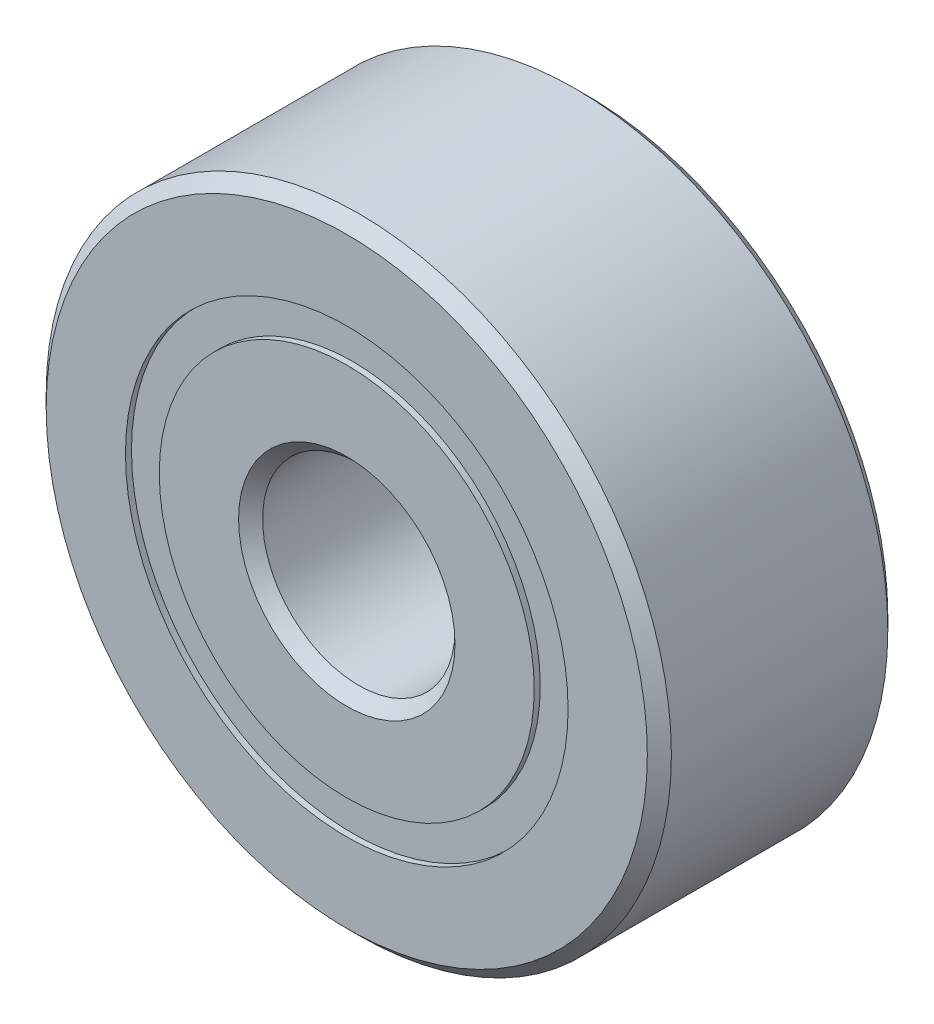
ISO-10303-21;
HEADER;
FILE_DESCRIPTION(('STEP AP214'),'2;1');
FILE_NAME('part.step','',(''),(''),'','','');
FILE_SCHEMA(('AUTOMOTIVE_DESIGN { 1 0 10303 214 1 1 1 1 }'));
ENDSEC;
DATA;
#1=APPLICATION_CONTEXT('core data for automotive mechanical design processes');
#2=APPLICATION_PROTOCOL_DEFINITION('international standard','automotive_design',2000,#1);
#3=PRODUCT_CONTEXT('',#1,'mechanical');
#4=PRODUCT('Part','Part','',(#3));
#5=PRODUCT_RELATED_PRODUCT_CATEGORY('part','',(#4));
#6=PRODUCT_DEFINITION_FORMATION('','',#4);
#7=PRODUCT_DEFINITION_CONTEXT('part definition',#1,'design');
#8=PRODUCT_DEFINITION('design','',#6,#7);
#9=PRODUCT_DEFINITION_SHAPE('','',#8);
#10=(LENGTH_UNIT() NAMED_UNIT(*) SI_UNIT(.MILLI.,.METRE.));
#11=(NAMED_UNIT(*) PLANE_ANGLE_UNIT() SI_UNIT($,.RADIAN.));
#12=(NAMED_UNIT(*) SI_UNIT($,.STERADIAN.) SOLID_ANGLE_UNIT());
#13=UNCERTAINTY_MEASURE_WITH_UNIT(LENGTH_MEASURE(1.E-05),#10,'distance_accuracy_value','');
#14=(GEOMETRIC_REPRESENTATION_CONTEXT(3) GLOBAL_UNCERTAINTY_ASSIGNED_CONTEXT((#13)) GLOBAL_UNIT_ASSIGNED_CONTEXT((#10,
#11,#12)) REPRESENTATION_CONTEXT('',''));
#15=CARTESIAN_POINT('',(0.,0.,0.));
#16=DIRECTION('',(0.,0.,1.));
#17=DIRECTION('',(1.,0.,0.));
#18=AXIS2_PLACEMENT_3D('',#15,#16,#17);
#19=CARTESIAN_POINT('',(0.,4.60164835164835,-2.375));
#20=DIRECTION('',(0.,0.,1.));
#21=DIRECTION('',(1.,0.,0.));
#22=AXIS2_PLACEMENT_3D('',#19,#20,#21);
#23=PLANE('',#22);
#24=CARTESIAN_POINT('',(0.,0.,-2.375));
#25=DIRECTION('',(0.,0.,1.));
#26=DIRECTION('',(1.,0.,0.));
#27=AXIS2_PLACEMENT_3D('',#24,#25,#26);
#28=CIRCLE('',#27,4.60164835164835);
#29=CARTESIAN_POINT('',(4.60164835164835,0.,-2.375));
#30=VERTEX_POINT('',#29);
#31=EDGE_CURVE('E57',#30,#30,#28,.T.);
#32=ORIENTED_EDGE('',*,*,#31,.F.);
#33=EDGE_LOOP('',(#32));
#34=FACE_BOUND('',#33,.T.);
#35=CARTESIAN_POINT('',(0.,0.,-2.375));
#36=DIRECTION('',(0.,0.,1.));
#37=DIRECTION('',(1.,0.,0.));
#38=AXIS2_PLACEMENT_3D('',#35,#36,#37);
#39=CIRCLE('',#38,3.89835164835165);
#40=CARTESIAN_POINT('',(3.89835164835165,0.,-2.375));
#41=VERTEX_POINT('',#40);
#42=EDGE_CURVE('E11',#41,#41,#39,.T.);
#43=ORIENTED_EDGE('',*,*,#42,.T.);
#44=EDGE_LOOP('',(#43));
#45=FACE_BOUND('',#44,.T.);
#46=ADVANCED_FACE('F43',(#34,#45),#23,.F.);
#47=CARTESIAN_POINT('',(0.,0.,2.5));
#48=DIRECTION('',(0.,0.,1.));
#49=DIRECTION('',(1.,0.,0.));
#50=AXIS2_PLACEMENT_3D('',#47,#48,#49);
#51=CYLINDRICAL_SURFACE('',#50,3.89835164835165);
#52=ORIENTED_EDGE('',*,*,#42,.F.);
#53=EDGE_LOOP('',(#52));
#54=FACE_BOUND('',#53,.T.);
#55=CARTESIAN_POINT('',(0.,0.,-1.16542887575844));
#56=DIRECTION('',(0.,0.,1.));
#57=DIRECTION('',(1.,0.,0.));
#58=AXIS2_PLACEMENT_3D('',#55,#56,#57);
#59=CIRCLE('',#58,3.89835164835165);
#60=CARTESIAN_POINT('',(3.89835164835165,0.,-1.16542887575844));
#61=VERTEX_POINT('',#60);
#62=EDGE_CURVE('E49',#61,#61,#59,.T.);
#63=ORIENTED_EDGE('',*,*,#62,.T.);
#64=EDGE_LOOP('',(#63));
#65=FACE_BOUND('',#64,.T.);
#66=ADVANCED_FACE('F66',(#54,#65),#51,.F.);
#67=CARTESIAN_POINT('',(0.,4.60164835164835,-1.16542887575844));
#68=DIRECTION('',(0.,0.,-1.));
#69=DIRECTION('',(-1.,0.,0.));
#70=AXIS2_PLACEMENT_3D('',#67,#68,#69);
#71=PLANE('',#70);
#72=ORIENTED_EDGE('',*,*,#62,.F.);
#73=EDGE_LOOP('',(#72));
#74=FACE_BOUND('',#73,.T.);
#75=CARTESIAN_POINT('',(0.,0.,-1.16542887575844));
#76=DIRECTION('',(0.,0.,1.));
#77=DIRECTION('',(1.,0.,0.));
#78=AXIS2_PLACEMENT_3D('',#75,#76,#77);
#79=CIRCLE('',#78,4.60164835164835);
#80=CARTESIAN_POINT('',(4.60164835164835,0.,-1.16542887575844));
#81=VERTEX_POINT('',#80);
#82=EDGE_CURVE('E53',#81,#81,#79,.T.);
#83=ORIENTED_EDGE('',*,*,#82,.T.);
#84=EDGE_LOOP('',(#83));
#85=FACE_BOUND('',#84,.T.);
#86=ADVANCED_FACE('F70',(#74,#85),#71,.F.);
#87=CARTESIAN_POINT('',(0.,0.,2.5));
#88=DIRECTION('',(0.,0.,1.));
#89=DIRECTION('',(1.,0.,0.));
#90=AXIS2_PLACEMENT_3D('',#87,#88,#89);
#91=CYLINDRICAL_SURFACE('',#90,4.60164835164835);
#92=ORIENTED_EDGE('',*,*,#82,.F.);
#93=EDGE_LOOP('',(#92));
#94=FACE_BOUND('',#93,.T.);
#95=ORIENTED_EDGE('',*,*,#31,.T.);
#96=EDGE_LOOP('',(#95));
#97=FACE_BOUND('',#96,.T.);
#98=ADVANCED_FACE('F63',(#94,#97),#91,.T.);
#99=CLOSED_SHELL('',(#46,#66,#86,#98));
#100=MANIFOLD_SOLID_BREP('B2',#99);
#101=CARTESIAN_POINT('',(0.,4.60164835164835,2.375));
#102=DIRECTION('',(0.,0.,-1.));
#103=DIRECTION('',(-1.,0.,0.));
#104=AXIS2_PLACEMENT_3D('',#101,#102,#103);
#105=PLANE('',#104);
#106=CARTESIAN_POINT('',(0.,0.,2.375));
#107=DIRECTION('',(0.,0.,1.));
#108=DIRECTION('',(1.,0.,0.));
#109=AXIS2_PLACEMENT_3D('',#106,#107,#108);
#110=CIRCLE('',#109,3.89835164835165);
#111=CARTESIAN_POINT('',(3.89835164835165,0.,2.375));
#112=VERTEX_POINT('',#111);
#113=EDGE_CURVE('E42',#112,#112,#110,.T.);
#114=ORIENTED_EDGE('',*,*,#113,.F.);
#115=EDGE_LOOP('',(#114));
#116=FACE_BOUND('',#115,.T.);
#117=CARTESIAN_POINT('',(0.,0.,2.375));
#118=DIRECTION('',(0.,0.,1.));
#119=DIRECTION('',(1.,0.,0.));
#120=AXIS2_PLACEMENT_3D('',#117,#118,#119);
#121=CIRCLE('',#120,4.60164835164835);
#122=CARTESIAN_POINT('',(4.60164835164835,0.,2.375));
#123=VERTEX_POINT('',#122);
#124=EDGE_CURVE('E124',#123,#123,#121,.T.);
#125=ORIENTED_EDGE('',*,*,#124,.T.);
#126=EDGE_LOOP('',(#125));
#127=FACE_BOUND('',#126,.T.);
#128=ADVANCED_FACE('F110',(#116,#127),#105,.F.);
#129=CARTESIAN_POINT('',(0.,0.,2.5));
#130=DIRECTION('',(0.,0.,1.));
#131=DIRECTION('',(1.,0.,0.));
#132=AXIS2_PLACEMENT_3D('',#129,#130,#131);
#133=CYLINDRICAL_SURFACE('',#132,3.89835164835165);
#134=CARTESIAN_POINT('',(0.,0.,1.16542887575844));
#135=DIRECTION('',(0.,0.,1.));
#136=DIRECTION('',(1.,0.,0.));
#137=AXIS2_PLACEMENT_3D('',#134,#135,#136);
#138=CIRCLE('',#137,3.89835164835165);
#139=CARTESIAN_POINT('',(3.89835164835165,0.,1.16542887575844));
#140=VERTEX_POINT('',#139);
#141=EDGE_CURVE('E116',#140,#140,#138,.T.);
#142=ORIENTED_EDGE('',*,*,#141,.F.);
#143=EDGE_LOOP('',(#142));
#144=FACE_BOUND('',#143,.T.);
#145=ORIENTED_EDGE('',*,*,#113,.T.);
#146=EDGE_LOOP('',(#145));
#147=FACE_BOUND('',#146,.T.);
#148=ADVANCED_FACE('F139',(#144,#147),#133,.F.);
#149=CARTESIAN_POINT('',(0.,4.60164835164835,1.16542887575844));
#150=DIRECTION('',(0.,0.,1.));
#151=DIRECTION('',(1.,0.,0.));
#152=AXIS2_PLACEMENT_3D('',#149,#150,#151);
#153=PLANE('',#152);
#154=CARTESIAN_POINT('',(0.,0.,1.16542887575844));
#155=DIRECTION('',(0.,0.,1.));
#156=DIRECTION('',(1.,0.,0.));
#157=AXIS2_PLACEMENT_3D('',#154,#155,#156);
#158=CIRCLE('',#157,4.60164835164835);
#159=CARTESIAN_POINT('',(4.60164835164835,0.,1.16542887575844));
#160=VERTEX_POINT('',#159);
#161=EDGE_CURVE('E120',#160,#160,#158,.T.);
#162=ORIENTED_EDGE('',*,*,#161,.F.);
#163=EDGE_LOOP('',(#162));
#164=FACE_BOUND('',#163,.T.);
#165=ORIENTED_EDGE('',*,*,#141,.T.);
#166=EDGE_LOOP('',(#165));
#167=FACE_BOUND('',#166,.T.);
#168=ADVANCED_FACE('F134',(#164,#167),#153,.F.);
#169=CARTESIAN_POINT('',(0.,0.,2.5));
#170=DIRECTION('',(0.,0.,1.));
#171=DIRECTION('',(1.,0.,0.));
#172=AXIS2_PLACEMENT_3D('',#169,#170,#171);
#173=CYLINDRICAL_SURFACE('',#172,4.60164835164835);
#174=ORIENTED_EDGE('',*,*,#124,.F.);
#175=EDGE_LOOP('',(#174));
#176=FACE_BOUND('',#175,.T.);
#177=ORIENTED_EDGE('',*,*,#161,.T.);
#178=EDGE_LOOP('',(#177));
#179=FACE_BOUND('',#178,.T.);
#180=ADVANCED_FACE('F131',(#176,#179),#173,.T.);
#181=CLOSED_SHELL('',(#128,#148,#168,#180));
#182=MANIFOLD_SOLID_BREP('B6',#181);
#183=CARTESIAN_POINT('',(-2.12499999999995,3.68060796608389,0.));
#184=DIRECTION('',(0.,0.,1.));
#185=DIRECTION('',(-0.499999999999989,0.866025403784445,0.));
#186=AXIS2_PLACEMENT_3D('',#183,#184,#185);
#187=SPHERICAL_SURFACE('',#186,1.16542887575844);
#188=CARTESIAN_POINT('',(-2.12499999999995,3.68060796608389,1.16542887575844));
#189=VERTEX_POINT('',#188);
#190=VERTEX_LOOP('',#189);
#191=FACE_BOUND('',#190,.T.);
#192=ADVANCED_FACE('F177',(#191),#187,.T.);
#193=CLOSED_SHELL('',(#192));
#194=MANIFOLD_SOLID_BREP('B37',#193);
#195=CARTESIAN_POINT('',(-3.68060796608384,2.12500000000004,0.));
#196=DIRECTION('',(0.,0.,1.));
#197=DIRECTION('',(-0.866025403784433,0.50000000000001,0.));
#198=AXIS2_PLACEMENT_3D('',#195,#196,#197);
#199=SPHERICAL_SURFACE('',#198,1.16542887575844);
#200=CARTESIAN_POINT('',(-3.68060796608384,2.12500000000004,1.16542887575844));
#201=VERTEX_POINT('',#200);
#202=VERTEX_LOOP('',#201);
#203=FACE_BOUND('',#202,.T.);
#204=ADVANCED_FACE('F197',(#203),#199,.T.);
#205=CLOSED_SHELL('',(#204));
#206=MANIFOLD_SOLID_BREP('B106',#205);
#207=CARTESIAN_POINT('',(-4.25,0.,0.));
#208=DIRECTION('',(0.,0.,1.));
#209=DIRECTION('',(-1.,0.,0.));
#210=AXIS2_PLACEMENT_3D('',#207,#208,#209);
#211=SPHERICAL_SURFACE('',#210,1.16542887575844);
#212=CARTESIAN_POINT('',(-4.25,0.,1.16542887575844));
#213=VERTEX_POINT('',#212);
#214=VERTEX_LOOP('',#213);
#215=FACE_BOUND('',#214,.T.);
#216=ADVANCED_FACE('F217',(#215),#211,.T.);
#217=CLOSED_SHELL('',(#216));
#218=MANIFOLD_SOLID_BREP('B173',#217);
#219=CARTESIAN_POINT('',(-3.68060796608388,-2.12499999999997,0.));
#220=DIRECTION('',(0.,0.,1.));
#221=DIRECTION('',(-0.866025403784443,-0.499999999999992,0.));
#222=AXIS2_PLACEMENT_3D('',#219,#220,#221);
#223=SPHERICAL_SURFACE('',#222,1.16542887575844);
#224=CARTESIAN_POINT('',(-3.68060796608388,-2.12499999999997,1.16542887575844));
#225=VERTEX_POINT('',#224);
#226=VERTEX_LOOP('',#225);
#227=FACE_BOUND('',#226,.T.);
#228=ADVANCED_FACE('F237',(#227),#223,.T.);
#229=CLOSED_SHELL('',(#228));
#230=MANIFOLD_SOLID_BREP('B193',#229);
#231=CARTESIAN_POINT('',(-2.12500000000003,-3.68060796608385,0.));
#232=DIRECTION('',(0.,0.,1.));
#233=DIRECTION('',(-0.500000000000007,-0.866025403784435,0.));
#234=AXIS2_PLACEMENT_3D('',#231,#232,#233);
#235=SPHERICAL_SURFACE('',#234,1.16542887575844);
#236=CARTESIAN_POINT('',(-2.12500000000003,-3.68060796608385,1.16542887575844));
#237=VERTEX_POINT('',#236);
#238=VERTEX_LOOP('',#237);
#239=FACE_BOUND('',#238,.T.);
#240=ADVANCED_FACE('F258',(#239),#235,.T.);
#241=CLOSED_SHELL('',(#240));
#242=MANIFOLD_SOLID_BREP('B213',#241);
#243=CARTESIAN_POINT('',(0.,-4.25,0.));
#244=DIRECTION('',(0.,0.,1.));
#245=DIRECTION('',(0.,-1.,0.));
#246=AXIS2_PLACEMENT_3D('',#243,#244,#245);
#247=SPHERICAL_SURFACE('',#246,1.16542887575844);
#248=CARTESIAN_POINT('',(0.,-4.25,1.16542887575844));
#249=VERTEX_POINT('',#248);
#250=VERTEX_LOOP('',#249);
#251=FACE_BOUND('',#250,.T.);
#252=ADVANCED_FACE('F281',(#251),#247,.T.);
#253=CLOSED_SHELL('',(#252));
#254=MANIFOLD_SOLID_BREP('B233',#253);
#255=CARTESIAN_POINT('',(2.12499999999998,-3.68060796608388,0.));
#256=DIRECTION('',(0.,0.,1.));
#257=DIRECTION('',(0.499999999999995,-0.866025403784442,0.));
#258=AXIS2_PLACEMENT_3D('',#255,#256,#257);
#259=SPHERICAL_SURFACE('',#258,1.16542887575844);
#260=CARTESIAN_POINT('',(2.12499999999998,-3.68060796608388,1.16542887575844));
#261=VERTEX_POINT('',#260);
#262=VERTEX_LOOP('',#261);
#263=FACE_BOUND('',#262,.T.);
#264=ADVANCED_FACE('F301',(#263),#259,.T.);
#265=CLOSED_SHELL('',(#264));
#266=MANIFOLD_SOLID_BREP('B254',#265);
#267=CARTESIAN_POINT('',(3.68060796608386,-2.12500000000002,0.));
#268=DIRECTION('',(0.,0.,1.));
#269=DIRECTION('',(0.866025403784436,-0.500000000000004,0.));
#270=AXIS2_PLACEMENT_3D('',#267,#268,#269);
#271=SPHERICAL_SURFACE('',#270,1.16542887575844);
#272=CARTESIAN_POINT('',(3.68060796608386,-2.12500000000002,1.16542887575844));
#273=VERTEX_POINT('',#272);
#274=VERTEX_LOOP('',#273);
#275=FACE_BOUND('',#274,.T.);
#276=ADVANCED_FACE('F321',(#275),#271,.T.);
#277=CLOSED_SHELL('',(#276));
#278=MANIFOLD_SOLID_BREP('B277',#277);
#279=CARTESIAN_POINT('',(4.25,0.,0.));
#280=DIRECTION('',(0.,0.,1.));
#281=DIRECTION('',(1.,0.,0.));
#282=AXIS2_PLACEMENT_3D('',#279,#280,#281);
#283=SPHERICAL_SURFACE('',#282,1.16542887575844);
#284=CARTESIAN_POINT('',(4.25,0.,1.16542887575844));
#285=VERTEX_POINT('',#284);
#286=VERTEX_LOOP('',#285);
#287=FACE_BOUND('',#286,.T.);
#288=ADVANCED_FACE('F341',(#287),#283,.T.);
#289=CLOSED_SHELL('',(#288));
#290=MANIFOLD_SOLID_BREP('B297',#289);
#291=CARTESIAN_POINT('',(3.68060796608387,2.12499999999999,0.));
#292=DIRECTION('',(0.,0.,1.));
#293=DIRECTION('',(0.86602540378444,0.499999999999998,0.));
#294=AXIS2_PLACEMENT_3D('',#291,#292,#293);
#295=SPHERICAL_SURFACE('',#294,1.16542887575844);
#296=CARTESIAN_POINT('',(3.68060796608387,2.12499999999999,1.16542887575844));
#297=VERTEX_POINT('',#296);
#298=VERTEX_LOOP('',#297);
#299=FACE_BOUND('',#298,.T.);
#300=ADVANCED_FACE('F361',(#299),#295,.T.);
#301=CLOSED_SHELL('',(#300));
#302=MANIFOLD_SOLID_BREP('B317',#301);
#303=CARTESIAN_POINT('',(2.125,3.68060796608386,0.));
#304=DIRECTION('',(0.,0.,1.));
#305=DIRECTION('',(0.500000000000001,0.866025403784438,0.));
#306=AXIS2_PLACEMENT_3D('',#303,#304,#305);
#307=SPHERICAL_SURFACE('',#306,1.16542887575844);
#308=CARTESIAN_POINT('',(2.125,3.68060796608386,1.16542887575844));
#309=VERTEX_POINT('',#308);
#310=VERTEX_LOOP('',#309);
#311=FACE_BOUND('',#310,.T.);
#312=ADVANCED_FACE('F381',(#311),#307,.T.);
#313=CLOSED_SHELL('',(#312));
#314=MANIFOLD_SOLID_BREP('B337',#313);
#315=CARTESIAN_POINT('',(0.,4.25,0.));
#316=DIRECTION('',(0.,0.,1.));
#317=DIRECTION('',(0.,1.,0.));
#318=AXIS2_PLACEMENT_3D('',#315,#316,#317);
#319=SPHERICAL_SURFACE('',#318,1.16542887575844);
#320=CARTESIAN_POINT('',(0.,4.25,1.16542887575844));
#321=VERTEX_POINT('',#320);
#322=VERTEX_LOOP('',#321);
#323=FACE_BOUND('',#322,.T.);
#324=ADVANCED_FACE('F404',(#323),#319,.T.);
#325=CLOSED_SHELL('',(#324));
#326=MANIFOLD_SOLID_BREP('B357',#325);
#327=CARTESIAN_POINT('',(0.,3.89835164835165,2.5));
#328=DIRECTION('',(0.,0.,-1.));
#329=DIRECTION('',(-1.,0.,0.));
#330=AXIS2_PLACEMENT_3D('',#327,#328,#329);
#331=PLANE('',#330);
#332=CARTESIAN_POINT('',(0.,0.,2.5));
#333=DIRECTION('',(0.,0.,1.));
#334=DIRECTION('',(1.,0.,0.));
#335=AXIS2_PLACEMENT_3D('',#332,#333,#334);
#336=CIRCLE('',#335,2.25);
#337=CARTESIAN_POINT('',(2.25,0.,2.5));
#338=VERTEX_POINT('',#337);
#339=EDGE_CURVE('E454',#338,#338,#336,.T.);
#340=ORIENTED_EDGE('',*,*,#339,.F.);
#341=EDGE_LOOP('',(#340));
#342=FACE_BOUND('',#341,.T.);
#343=CARTESIAN_POINT('',(0.,0.,2.5));
#344=DIRECTION('',(0.,0.,1.));
#345=DIRECTION('',(1.,0.,0.));
#346=AXIS2_PLACEMENT_3D('',#343,#344,#345);
#347=CIRCLE('',#346,3.89835164835165);
#348=CARTESIAN_POINT('',(3.89835164835165,0.,2.5));
#349=VERTEX_POINT('',#348);
#350=EDGE_CURVE('E403',#349,#349,#347,.T.);
#351=ORIENTED_EDGE('',*,*,#350,.T.);
#352=EDGE_LOOP('',(#351));
#353=FACE_BOUND('',#352,.T.);
#354=ADVANCED_FACE('F426',(#342,#353),#331,.F.);
#355=CARTESIAN_POINT('',(0.,0.,2.5));
#356=DIRECTION('',(0.,0.,1.));
#357=DIRECTION('',(1.,0.,0.));
#358=AXIS2_PLACEMENT_3D('',#355,#356,#357);
#359=CYLINDRICAL_SURFACE('',#358,3.89835164835165);
#360=ORIENTED_EDGE('',*,*,#350,.F.);
#361=EDGE_LOOP('',(#360));
#362=FACE_BOUND('',#361,.T.);
#363=CARTESIAN_POINT('',(0.,0.,1.11111111111111));
#364=DIRECTION('',(0.,0.,1.));
#365=DIRECTION('',(1.,0.,0.));
#366=AXIS2_PLACEMENT_3D('',#363,#364,#365);
#367=CIRCLE('',#366,3.89835164835165);
#368=CARTESIAN_POINT('',(3.89835164835165,0.,1.11111111111111));
#369=VERTEX_POINT('',#368);
#370=EDGE_CURVE('E432',#369,#369,#367,.T.);
#371=ORIENTED_EDGE('',*,*,#370,.T.);
#372=EDGE_LOOP('',(#371));
#373=FACE_BOUND('',#372,.T.);
#374=ADVANCED_FACE('F461',(#362,#373),#359,.T.);
#375=CARTESIAN_POINT('',(0.,0.,0.));
#376=DIRECTION('',(0.,0.,1.));
#377=DIRECTION('',(1.,0.,0.));
#378=AXIS2_PLACEMENT_3D('',#375,#376,#377);
#379=TOROIDAL_SURFACE('',#378,4.25,1.16542887575843);
#380=ORIENTED_EDGE('',*,*,#370,.F.);
#381=EDGE_LOOP('',(#380));
#382=FACE_BOUND('',#381,.T.);
#383=CARTESIAN_POINT('',(0.,0.,-1.11111111111111));
#384=DIRECTION('',(0.,0.,1.));
#385=DIRECTION('',(1.,0.,0.));
#386=AXIS2_PLACEMENT_3D('',#383,#384,#385);
#387=CIRCLE('',#386,3.89835164835165);
#388=CARTESIAN_POINT('',(3.89835164835165,0.,-1.11111111111111));
#389=VERTEX_POINT('',#388);
#390=EDGE_CURVE('E436',#389,#389,#387,.T.);
#391=ORIENTED_EDGE('',*,*,#390,.T.);
#392=EDGE_LOOP('',(#391));
#393=FACE_BOUND('',#392,.T.);
#394=ADVANCED_FACE('F465',(#382,#393),#379,.F.);
#395=CARTESIAN_POINT('',(0.,0.,2.5));
#396=DIRECTION('',(0.,0.,1.));
#397=DIRECTION('',(1.,0.,0.));
#398=AXIS2_PLACEMENT_3D('',#395,#396,#397);
#399=CYLINDRICAL_SURFACE('',#398,3.89835164835165);
#400=ORIENTED_EDGE('',*,*,#390,.F.);
#401=EDGE_LOOP('',(#400));
#402=FACE_BOUND('',#401,.T.);
#403=CARTESIAN_POINT('',(0.,0.,-2.5));
#404=DIRECTION('',(0.,0.,1.));
#405=DIRECTION('',(1.,0.,0.));
#406=AXIS2_PLACEMENT_3D('',#403,#404,#405);
#407=CIRCLE('',#406,3.89835164835165);
#408=CARTESIAN_POINT('',(3.89835164835165,0.,-2.5));
#409=VERTEX_POINT('',#408);
#410=EDGE_CURVE('E440',#409,#409,#407,.T.);
#411=ORIENTED_EDGE('',*,*,#410,.T.);
#412=EDGE_LOOP('',(#411));
#413=FACE_BOUND('',#412,.T.);
#414=ADVANCED_FACE('F470',(#402,#413),#399,.T.);
#415=CARTESIAN_POINT('',(0.,2.25,-2.5));
#416=DIRECTION('',(0.,0.,1.));
#417=DIRECTION('',(1.,0.,0.));
#418=AXIS2_PLACEMENT_3D('',#415,#416,#417);
#419=PLANE('',#418);
#420=ORIENTED_EDGE('',*,*,#410,.F.);
#421=EDGE_LOOP('',(#420));
#422=FACE_BOUND('',#421,.T.);
#423=CARTESIAN_POINT('',(0.,0.,-2.5));
#424=DIRECTION('',(0.,0.,1.));
#425=DIRECTION('',(1.,0.,0.));
#426=AXIS2_PLACEMENT_3D('',#423,#424,#425);
#427=CIRCLE('',#426,2.25);
#428=CARTESIAN_POINT('',(2.25,0.,-2.5));
#429=VERTEX_POINT('',#428);
#430=EDGE_CURVE('E445',#429,#429,#427,.T.);
#431=ORIENTED_EDGE('',*,*,#430,.T.);
#432=EDGE_LOOP('',(#431));
#433=FACE_BOUND('',#432,.T.);
#434=ADVANCED_FACE('F476',(#422,#433),#419,.F.);
#435=CARTESIAN_POINT('',(0.,0.,-2.25));
#436=DIRECTION('',(0.,0.,-1.));
#437=DIRECTION('',(-1.,0.,0.));
#438=AXIS2_PLACEMENT_3D('',#435,#436,#437);
#439=CONICAL_SURFACE('',#438,2.,0.785398163397445);
#440=ORIENTED_EDGE('',*,*,#430,.F.);
#441=EDGE_LOOP('',(#440));
#442=FACE_BOUND('',#441,.T.);
#443=CARTESIAN_POINT('',(0.,0.,-2.25));
#444=DIRECTION('',(0.,0.,1.));
#445=DIRECTION('',(1.,0.,0.));
#446=AXIS2_PLACEMENT_3D('',#443,#444,#445);
#447=CIRCLE('',#446,2.);
#448=CARTESIAN_POINT('',(2.,0.,-2.25));
#449=VERTEX_POINT('',#448);
#450=EDGE_CURVE('E448',#449,#449,#447,.T.);
#451=ORIENTED_EDGE('',*,*,#450,.T.);
#452=EDGE_LOOP('',(#451));
#453=FACE_BOUND('',#452,.T.);
#454=ADVANCED_FACE('F480',(#442,#453),#439,.F.);
#455=CARTESIAN_POINT('',(0.,0.,2.5));
#456=DIRECTION('',(0.,0.,1.));
#457=DIRECTION('',(1.,0.,0.));
#458=AXIS2_PLACEMENT_3D('',#455,#456,#457);
#459=CYLINDRICAL_SURFACE('',#458,2.);
#460=ORIENTED_EDGE('',*,*,#450,.F.);
#461=EDGE_LOOP('',(#460));
#462=FACE_BOUND('',#461,.T.);
#463=CARTESIAN_POINT('',(0.,0.,2.25));
#464=DIRECTION('',(0.,0.,1.));
#465=DIRECTION('',(1.,0.,0.));
#466=AXIS2_PLACEMENT_3D('',#463,#464,#465);
#467=CIRCLE('',#466,2.);
#468=CARTESIAN_POINT('',(2.,0.,2.25));
#469=VERTEX_POINT('',#468);
#470=EDGE_CURVE('E451',#469,#469,#467,.T.);
#471=ORIENTED_EDGE('',*,*,#470,.T.);
#472=EDGE_LOOP('',(#471));
#473=FACE_BOUND('',#472,.T.);
#474=ADVANCED_FACE('F484',(#462,#473),#459,.F.);
#475=CARTESIAN_POINT('',(0.,0.,2.5));
#476=DIRECTION('',(0.,0.,1.));
#477=DIRECTION('',(1.,0.,0.));
#478=AXIS2_PLACEMENT_3D('',#475,#476,#477);
#479=CONICAL_SURFACE('',#478,2.25,0.785398163397452);
#480=ORIENTED_EDGE('',*,*,#470,.F.);
#481=EDGE_LOOP('',(#480));
#482=FACE_BOUND('',#481,.T.);
#483=ORIENTED_EDGE('',*,*,#339,.T.);
#484=EDGE_LOOP('',(#483));
#485=FACE_BOUND('',#484,.T.);
#486=ADVANCED_FACE('F458',(#482,#485),#479,.F.);
#487=CLOSED_SHELL('',(#354,#374,#394,#414,#434,#454,#474,#486));
#488=MANIFOLD_SOLID_BREP('B377',#487);
#489=CARTESIAN_POINT('',(0.,0.,2.25));
#490=DIRECTION('',(0.,0.,-1.));
#491=DIRECTION('',(-1.,0.,0.));
#492=AXIS2_PLACEMENT_3D('',#489,#490,#491);
#493=CONICAL_SURFACE('',#492,6.5,0.785398163397445);
#494=CARTESIAN_POINT('',(0.,0.,2.5));
#495=DIRECTION('',(0.,0.,1.));
#496=DIRECTION('',(1.,0.,0.));
#497=AXIS2_PLACEMENT_3D('',#494,#495,#496);
#498=CIRCLE('',#497,6.25);
#499=CARTESIAN_POINT('',(6.25,0.,2.5));
#500=VERTEX_POINT('',#499);
#501=EDGE_CURVE('E575',#500,#500,#498,.T.);
#502=ORIENTED_EDGE('',*,*,#501,.F.);
#503=EDGE_LOOP('',(#502));
#504=FACE_BOUND('',#503,.T.);
#505=CARTESIAN_POINT('',(0.,0.,2.25));
#506=DIRECTION('',(0.,0.,1.));
#507=DIRECTION('',(1.,0.,0.));
#508=AXIS2_PLACEMENT_3D('',#505,#506,#507);
#509=CIRCLE('',#508,6.5);
#510=CARTESIAN_POINT('',(6.5,0.,2.25));
#511=VERTEX_POINT('',#510);
#512=EDGE_CURVE('E425',#511,#511,#509,.T.);
#513=ORIENTED_EDGE('',*,*,#512,.T.);
#514=EDGE_LOOP('',(#513));
#515=FACE_BOUND('',#514,.T.);
#516=ADVANCED_FACE('F547',(#504,#515),#493,.T.);
#517=CARTESIAN_POINT('',(0.,0.,2.5));
#518=DIRECTION('',(0.,0.,1.));
#519=DIRECTION('',(1.,0.,0.));
#520=AXIS2_PLACEMENT_3D('',#517,#518,#519);
#521=CYLINDRICAL_SURFACE('',#520,6.5);
#522=ORIENTED_EDGE('',*,*,#512,.F.);
#523=EDGE_LOOP('',(#522));
#524=FACE_BOUND('',#523,.T.);
#525=CARTESIAN_POINT('',(0.,0.,-2.25));
#526=DIRECTION('',(0.,0.,1.));
#527=DIRECTION('',(1.,0.,0.));
#528=AXIS2_PLACEMENT_3D('',#525,#526,#527);
#529=CIRCLE('',#528,6.5);
#530=CARTESIAN_POINT('',(6.5,0.,-2.25));
#531=VERTEX_POINT('',#530);
#532=EDGE_CURVE('E553',#531,#531,#529,.T.);
#533=ORIENTED_EDGE('',*,*,#532,.T.);
#534=EDGE_LOOP('',(#533));
#535=FACE_BOUND('',#534,.T.);
#536=ADVANCED_FACE('F582',(#524,#535),#521,.T.);
#537=CARTESIAN_POINT('',(0.,0.,-2.5));
#538=DIRECTION('',(0.,0.,1.));
#539=DIRECTION('',(1.,0.,0.));
#540=AXIS2_PLACEMENT_3D('',#537,#538,#539);
#541=CONICAL_SURFACE('',#540,6.25,0.785398163397445);
#542=ORIENTED_EDGE('',*,*,#532,.F.);
#543=EDGE_LOOP('',(#542));
#544=FACE_BOUND('',#543,.T.);
#545=CARTESIAN_POINT('',(0.,0.,-2.5));
#546=DIRECTION('',(0.,0.,1.));
#547=DIRECTION('',(1.,0.,0.));
#548=AXIS2_PLACEMENT_3D('',#545,#546,#547);
#549=CIRCLE('',#548,6.25);
#550=CARTESIAN_POINT('',(6.25,0.,-2.5));
#551=VERTEX_POINT('',#550);
#552=EDGE_CURVE('E557',#551,#551,#549,.T.);
#553=ORIENTED_EDGE('',*,*,#552,.T.);
#554=EDGE_LOOP('',(#553));
#555=FACE_BOUND('',#554,.T.);
#556=ADVANCED_FACE('F586',(#544,#555),#541,.T.);
#557=CARTESIAN_POINT('',(0.,6.25,-2.5));
#558=DIRECTION('',(0.,0.,1.));
#559=DIRECTION('',(1.,0.,0.));
#560=AXIS2_PLACEMENT_3D('',#557,#558,#559);
#561=PLANE('',#560);
#562=ORIENTED_EDGE('',*,*,#552,.F.);
#563=EDGE_LOOP('',(#562));
#564=FACE_BOUND('',#563,.T.);
#565=CARTESIAN_POINT('',(0.,0.,-2.5));
#566=DIRECTION('',(0.,0.,1.));
#567=DIRECTION('',(1.,0.,0.));
#568=AXIS2_PLACEMENT_3D('',#565,#566,#567);
#569=CIRCLE('',#568,4.60164835164835);
#570=CARTESIAN_POINT('',(4.60164835164835,0.,-2.5));
#571=VERTEX_POINT('',#570);
#572=EDGE_CURVE('E561',#571,#571,#569,.T.);
#573=ORIENTED_EDGE('',*,*,#572,.T.);
#574=EDGE_LOOP('',(#573));
#575=FACE_BOUND('',#574,.T.);
#576=ADVANCED_FACE('F591',(#564,#575),#561,.F.);
#577=CARTESIAN_POINT('',(0.,0.,2.5));
#578=DIRECTION('',(0.,0.,1.));
#579=DIRECTION('',(1.,0.,0.));
#580=AXIS2_PLACEMENT_3D('',#577,#578,#579);
#581=CYLINDRICAL_SURFACE('',#580,4.60164835164835);
#582=ORIENTED_EDGE('',*,*,#572,.F.);
#583=EDGE_LOOP('',(#582));
#584=FACE_BOUND('',#583,.T.);
#585=CARTESIAN_POINT('',(0.,0.,-1.11111111111111));
#586=DIRECTION('',(0.,0.,1.));
#587=DIRECTION('',(1.,0.,0.));
#588=AXIS2_PLACEMENT_3D('',#585,#586,#587);
#589=CIRCLE('',#588,4.60164835164835);
#590=CARTESIAN_POINT('',(4.60164835164835,0.,-1.11111111111111));
#591=VERTEX_POINT('',#590);
#592=EDGE_CURVE('E566',#591,#591,#589,.T.);
#593=ORIENTED_EDGE('',*,*,#592,.T.);
#594=EDGE_LOOP('',(#593));
#595=FACE_BOUND('',#594,.T.);
#596=ADVANCED_FACE('F597',(#584,#595),#581,.F.);
#597=CARTESIAN_POINT('',(0.,0.,0.));
#598=DIRECTION('',(0.,0.,1.));
#599=DIRECTION('',(1.,0.,0.));
#600=AXIS2_PLACEMENT_3D('',#597,#598,#599);
#601=TOROIDAL_SURFACE('',#600,4.25,1.16542887575844);
#602=ORIENTED_EDGE('',*,*,#592,.F.);
#603=EDGE_LOOP('',(#602));
#604=FACE_BOUND('',#603,.T.);
#605=CARTESIAN_POINT('',(0.,0.,1.11111111111111));
#606=DIRECTION('',(0.,0.,1.));
#607=DIRECTION('',(1.,0.,0.));
#608=AXIS2_PLACEMENT_3D('',#605,#606,#607);
#609=CIRCLE('',#608,4.60164835164835);
#610=CARTESIAN_POINT('',(4.60164835164835,0.,1.11111111111111));
#611=VERTEX_POINT('',#610);
#612=EDGE_CURVE('E569',#611,#611,#609,.T.);
#613=ORIENTED_EDGE('',*,*,#612,.T.);
#614=EDGE_LOOP('',(#613));
#615=FACE_BOUND('',#614,.T.);
#616=ADVANCED_FACE('F601',(#604,#615),#601,.F.);
#617=CARTESIAN_POINT('',(0.,0.,2.5));
#618=DIRECTION('',(0.,0.,1.));
#619=DIRECTION('',(1.,0.,0.));
#620=AXIS2_PLACEMENT_3D('',#617,#618,#619);
#621=CYLINDRICAL_SURFACE('',#620,4.60164835164835);
#622=ORIENTED_EDGE('',*,*,#612,.F.);
#623=EDGE_LOOP('',(#622));
#624=FACE_BOUND('',#623,.T.);
#625=CARTESIAN_POINT('',(0.,0.,2.5));
#626=DIRECTION('',(0.,0.,1.));
#627=DIRECTION('',(1.,0.,0.));
#628=AXIS2_PLACEMENT_3D('',#625,#626,#627);
#629=CIRCLE('',#628,4.60164835164835);
#630=CARTESIAN_POINT('',(4.60164835164835,0.,2.5));
#631=VERTEX_POINT('',#630);
#632=EDGE_CURVE('E572',#631,#631,#629,.T.);
#633=ORIENTED_EDGE('',*,*,#632,.T.);
#634=EDGE_LOOP('',(#633));
#635=FACE_BOUND('',#634,.T.);
#636=ADVANCED_FACE('F605',(#624,#635),#621,.F.);
#637=CARTESIAN_POINT('',(0.,6.25,2.5));
#638=DIRECTION('',(0.,0.,-1.));
#639=DIRECTION('',(-1.,0.,0.));
#640=AXIS2_PLACEMENT_3D('',#637,#638,#639);
#641=PLANE('',#640);
#642=ORIENTED_EDGE('',*,*,#632,.F.);
#643=EDGE_LOOP('',(#642));
#644=FACE_BOUND('',#643,.T.);
#645=ORIENTED_EDGE('',*,*,#501,.T.);
#646=EDGE_LOOP('',(#645));
#647=FACE_BOUND('',#646,.T.);
#648=ADVANCED_FACE('F579',(#644,#647),#641,.F.);
#649=CLOSED_SHELL('',(#516,#536,#556,#576,#596,#616,#636,#648));
#650=MANIFOLD_SOLID_BREP('B398',#649);
#651=ADVANCED_BREP_SHAPE_REPRESENTATION('',(#18,#100,#182,#194,#206,#218,#230,#242,#254,#266,
#278,#290,#302,#314,#326,#488,#650),#14);
#652=SHAPE_DEFINITION_REPRESENTATION(#9,#651);
ENDSEC;
END-ISO-10303-21;
